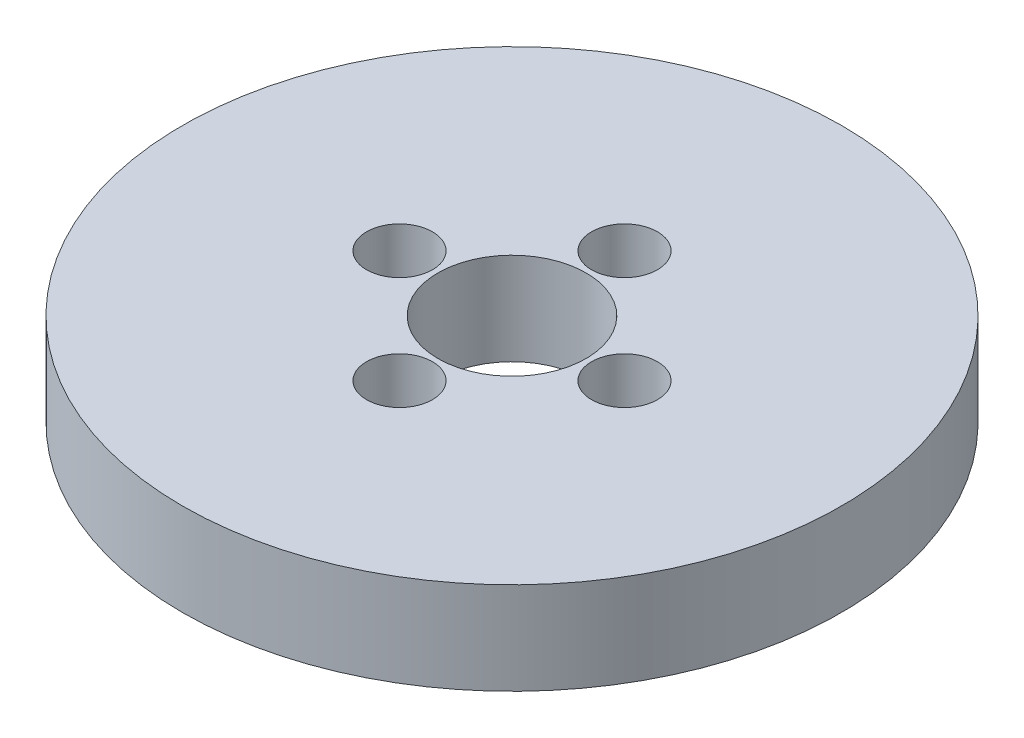
ISO-10303-21;
HEADER;
FILE_DESCRIPTION(('STEP AP214'),'2;1');
FILE_NAME('part.step','',(''),(''),'','','');
FILE_SCHEMA(('AUTOMOTIVE_DESIGN { 1 0 10303 214 1 1 1 1 }'));
ENDSEC;
DATA;
#1=APPLICATION_CONTEXT('core data for automotive mechanical design processes');
#2=APPLICATION_PROTOCOL_DEFINITION('international standard','automotive_design',2000,#1);
#3=PRODUCT_CONTEXT('',#1,'mechanical');
#4=PRODUCT('Part','Part','',(#3));
#5=PRODUCT_RELATED_PRODUCT_CATEGORY('part','',(#4));
#6=PRODUCT_DEFINITION_FORMATION('','',#4);
#7=PRODUCT_DEFINITION_CONTEXT('part definition',#1,'design');
#8=PRODUCT_DEFINITION('design','',#6,#7);
#9=PRODUCT_DEFINITION_SHAPE('','',#8);
#10=(LENGTH_UNIT() NAMED_UNIT(*) SI_UNIT(.MILLI.,.METRE.));
#11=(NAMED_UNIT(*) PLANE_ANGLE_UNIT() SI_UNIT($,.RADIAN.));
#12=(NAMED_UNIT(*) SI_UNIT($,.STERADIAN.) SOLID_ANGLE_UNIT());
#13=UNCERTAINTY_MEASURE_WITH_UNIT(LENGTH_MEASURE(1.E-05),#10,'distance_accuracy_value','');
#14=(GEOMETRIC_REPRESENTATION_CONTEXT(3) GLOBAL_UNCERTAINTY_ASSIGNED_CONTEXT((#13)) GLOBAL_UNIT_ASSIGNED_CONTEXT((#10,
#11,#12)) REPRESENTATION_CONTEXT('',''));
#15=CARTESIAN_POINT('',(0.,0.,0.));
#16=DIRECTION('',(0.,0.,1.));
#17=DIRECTION('',(1.,0.,0.));
#18=AXIS2_PLACEMENT_3D('',#15,#16,#17);
#19=CARTESIAN_POINT('',(0.,28.,0.));
#20=DIRECTION('',(0.,-1.,0.));
#21=DIRECTION('',(0.,0.,-1.));
#22=AXIS2_PLACEMENT_3D('',#19,#20,#21);
#23=CYLINDRICAL_SURFACE('',#22,100.);
#24=CARTESIAN_POINT('',(0.,28.,0.));
#25=DIRECTION('',(0.,1.,0.));
#26=DIRECTION('',(0.,0.,1.));
#27=AXIS2_PLACEMENT_3D('',#24,#25,#26);
#28=CIRCLE('',#27,100.);
#29=CARTESIAN_POINT('',(0.,28.,100.));
#30=VERTEX_POINT('',#29);
#31=EDGE_CURVE('E10',#30,#30,#28,.T.);
#32=ORIENTED_EDGE('',*,*,#31,.F.);
#33=EDGE_LOOP('',(#32));
#34=FACE_BOUND('',#33,.T.);
#35=CARTESIAN_POINT('',(0.,0.,0.));
#36=DIRECTION('',(0.,1.,0.));
#37=DIRECTION('',(0.,0.,1.));
#38=AXIS2_PLACEMENT_3D('',#35,#36,#37);
#39=CIRCLE('',#38,100.);
#40=CARTESIAN_POINT('',(0.,0.,100.));
#41=VERTEX_POINT('',#40);
#42=EDGE_CURVE('E37',#41,#41,#39,.T.);
#43=ORIENTED_EDGE('',*,*,#42,.T.);
#44=EDGE_LOOP('',(#43));
#45=FACE_BOUND('',#44,.T.);
#46=ADVANCED_FACE('F40',(#34,#45),#23,.T.);
#47=CARTESIAN_POINT('',(0.,28.,0.));
#48=DIRECTION('',(0.,1.,0.));
#49=DIRECTION('',(0.,0.,1.));
#50=AXIS2_PLACEMENT_3D('',#47,#48,#49);
#51=PLANE('',#50);
#52=CARTESIAN_POINT('',(1.19188812936759E-13,28.,34.1370327862761));
#53=DIRECTION('',(0.,1.,0.));
#54=DIRECTION('',(1.,0.,0.));
#55=AXIS2_PLACEMENT_3D('',#52,#53,#54);
#56=CIRCLE('',#55,10.);
#57=CARTESIAN_POINT('',(10.0000000000001,28.,34.137032786276));
#58=VERTEX_POINT('',#57);
#59=EDGE_CURVE('E71',#58,#58,#56,.T.);
#60=ORIENTED_EDGE('',*,*,#59,.F.);
#61=EDGE_LOOP('',(#60));
#62=FACE_BOUND('',#61,.T.);
#63=CARTESIAN_POINT('',(34.1370327862761,28.,0.));
#64=DIRECTION('',(0.,1.,0.));
#65=DIRECTION('',(0.,0.,-1.));
#66=AXIS2_PLACEMENT_3D('',#63,#64,#65);
#67=CIRCLE('',#66,10.);
#68=CARTESIAN_POINT('',(34.1370327862761,28.,-10.));
#69=VERTEX_POINT('',#68);
#70=EDGE_CURVE('E70',#69,#69,#67,.T.);
#71=ORIENTED_EDGE('',*,*,#70,.F.);
#72=EDGE_LOOP('',(#71));
#73=FACE_BOUND('',#72,.T.);
#74=CARTESIAN_POINT('',(-3.57566438810277E-13,28.,-34.1370327862761));
#75=DIRECTION('',(0.,1.,0.));
#76=DIRECTION('',(-1.,0.,0.));
#77=AXIS2_PLACEMENT_3D('',#74,#75,#76);
#78=CIRCLE('',#77,10.);
#79=CARTESIAN_POINT('',(-10.0000000000004,28.,-34.137032786276));
#80=VERTEX_POINT('',#79);
#81=EDGE_CURVE('E61',#80,#80,#78,.T.);
#82=ORIENTED_EDGE('',*,*,#81,.F.);
#83=EDGE_LOOP('',(#82));
#84=FACE_BOUND('',#83,.T.);
#85=CARTESIAN_POINT('',(-34.1370327862761,28.,0.));
#86=DIRECTION('',(0.,1.,0.));
#87=DIRECTION('',(0.,0.,1.));
#88=AXIS2_PLACEMENT_3D('',#85,#86,#87);
#89=CIRCLE('',#88,10.);
#90=CARTESIAN_POINT('',(-34.1370327862761,28.,10.));
#91=VERTEX_POINT('',#90);
#92=EDGE_CURVE('E54',#91,#91,#89,.T.);
#93=ORIENTED_EDGE('',*,*,#92,.F.);
#94=EDGE_LOOP('',(#93));
#95=FACE_BOUND('',#94,.T.);
#96=CARTESIAN_POINT('',(0.,28.,0.));
#97=DIRECTION('',(0.,1.,0.));
#98=DIRECTION('',(0.,0.,1.));
#99=AXIS2_PLACEMENT_3D('',#96,#97,#98);
#100=CIRCLE('',#99,22.5);
#101=CARTESIAN_POINT('',(0.,28.,22.5));
#102=VERTEX_POINT('',#101);
#103=EDGE_CURVE('E50',#102,#102,#100,.T.);
#104=ORIENTED_EDGE('',*,*,#103,.F.);
#105=EDGE_LOOP('',(#104));
#106=FACE_BOUND('',#105,.T.);
#107=ORIENTED_EDGE('',*,*,#31,.T.);
#108=EDGE_LOOP('',(#107));
#109=FACE_BOUND('',#108,.T.);
#110=ADVANCED_FACE('F86',(#62,#73,#84,#95,#106,#109),#51,.T.);
#111=CARTESIAN_POINT('',(0.,0.,0.));
#112=DIRECTION('',(0.,1.,0.));
#113=DIRECTION('',(0.,0.,1.));
#114=AXIS2_PLACEMENT_3D('',#111,#112,#113);
#115=PLANE('',#114);
#116=CARTESIAN_POINT('',(0.,0.,0.));
#117=DIRECTION('',(0.,1.,0.));
#118=DIRECTION('',(0.,0.,1.));
#119=AXIS2_PLACEMENT_3D('',#116,#117,#118);
#120=CIRCLE('',#119,22.5);
#121=CARTESIAN_POINT('',(0.,0.,22.5));
#122=VERTEX_POINT('',#121);
#123=EDGE_CURVE('E47',#122,#122,#120,.T.);
#124=ORIENTED_EDGE('',*,*,#123,.T.);
#125=EDGE_LOOP('',(#124));
#126=FACE_BOUND('',#125,.T.);
#127=ORIENTED_EDGE('',*,*,#42,.F.);
#128=EDGE_LOOP('',(#127));
#129=FACE_BOUND('',#128,.T.);
#130=ADVANCED_FACE('F93',(#126,#129),#115,.F.);
#131=CARTESIAN_POINT('',(0.,28.,0.));
#132=DIRECTION('',(0.,-1.,0.));
#133=DIRECTION('',(0.,0.,-1.));
#134=AXIS2_PLACEMENT_3D('',#131,#132,#133);
#135=CYLINDRICAL_SURFACE('',#134,22.5);
#136=ORIENTED_EDGE('',*,*,#103,.T.);
#137=EDGE_LOOP('',(#136));
#138=FACE_BOUND('',#137,.T.);
#139=ORIENTED_EDGE('',*,*,#123,.F.);
#140=EDGE_LOOP('',(#139));
#141=FACE_BOUND('',#140,.T.);
#142=ADVANCED_FACE('F101',(#138,#141),#135,.F.);
#143=CARTESIAN_POINT('',(-34.1370327862761,5.18105108486817,0.));
#144=DIRECTION('',(0.,1.,0.));
#145=DIRECTION('',(0.,0.,1.));
#146=AXIS2_PLACEMENT_3D('',#143,#144,#145);
#147=CYLINDRICAL_SURFACE('',#146,10.);
#148=CARTESIAN_POINT('',(-34.1370327862761,5.18105108486817,0.));
#149=DIRECTION('',(0.,1.,0.));
#150=DIRECTION('',(0.,0.,1.));
#151=AXIS2_PLACEMENT_3D('',#148,#149,#150);
#152=CIRCLE('',#151,10.);
#153=CARTESIAN_POINT('',(-34.1370327862761,5.18105108486817,10.));
#154=VERTEX_POINT('',#153);
#155=EDGE_CURVE('E55',#154,#154,#152,.T.);
#156=ORIENTED_EDGE('',*,*,#155,.F.);
#157=EDGE_LOOP('',(#156));
#158=FACE_BOUND('',#157,.T.);
#159=ORIENTED_EDGE('',*,*,#92,.T.);
#160=EDGE_LOOP('',(#159));
#161=FACE_BOUND('',#160,.T.);
#162=ADVANCED_FACE('F102',(#158,#161),#147,.F.);
#163=CARTESIAN_POINT('',(-34.1370327862761,5.18105108486817,0.));
#164=DIRECTION('',(0.,1.,0.));
#165=DIRECTION('',(0.,0.,1.));
#166=AXIS2_PLACEMENT_3D('',#163,#164,#165);
#167=PLANE('',#166);
#168=ORIENTED_EDGE('',*,*,#155,.T.);
#169=EDGE_LOOP('',(#168));
#170=FACE_BOUND('',#169,.T.);
#171=ADVANCED_FACE('F133',(#170),#167,.T.);
#172=CARTESIAN_POINT('',(-3.57566438810277E-13,5.18105108486817,-34.1370327862761));
#173=DIRECTION('',(0.,1.,0.));
#174=DIRECTION('',(0.,0.,1.));
#175=AXIS2_PLACEMENT_3D('',#172,#173,#174);
#176=CYLINDRICAL_SURFACE('',#175,10.);
#177=CARTESIAN_POINT('',(-3.57566438810277E-13,5.18105108486817,-34.1370327862761));
#178=DIRECTION('',(0.,1.,0.));
#179=DIRECTION('',(-1.,0.,0.));
#180=AXIS2_PLACEMENT_3D('',#177,#178,#179);
#181=CIRCLE('',#180,10.);
#182=CARTESIAN_POINT('',(-10.0000000000004,5.18105108486817,-34.137032786276));
#183=VERTEX_POINT('',#182);
#184=EDGE_CURVE('E63',#183,#183,#181,.T.);
#185=ORIENTED_EDGE('',*,*,#184,.F.);
#186=EDGE_LOOP('',(#185));
#187=FACE_BOUND('',#186,.T.);
#188=ORIENTED_EDGE('',*,*,#81,.T.);
#189=EDGE_LOOP('',(#188));
#190=FACE_BOUND('',#189,.T.);
#191=ADVANCED_FACE('F142',(#187,#190),#176,.F.);
#192=CARTESIAN_POINT('',(-3.57566438810277E-13,5.18105108486817,-34.1370327862761));
#193=DIRECTION('',(0.,1.,0.));
#194=DIRECTION('',(-1.,0.,0.));
#195=AXIS2_PLACEMENT_3D('',#192,#193,#194);
#196=PLANE('',#195);
#197=ORIENTED_EDGE('',*,*,#184,.T.);
#198=EDGE_LOOP('',(#197));
#199=FACE_BOUND('',#198,.T.);
#200=ADVANCED_FACE('F156',(#199),#196,.T.);
#201=CARTESIAN_POINT('',(34.1370327862761,5.18105108486817,0.));
#202=DIRECTION('',(0.,1.,0.));
#203=DIRECTION('',(0.,0.,1.));
#204=AXIS2_PLACEMENT_3D('',#201,#202,#203);
#205=CYLINDRICAL_SURFACE('',#204,10.);
#206=CARTESIAN_POINT('',(34.1370327862761,5.18105108486817,0.));
#207=DIRECTION('',(0.,1.,0.));
#208=DIRECTION('',(0.,0.,-1.));
#209=AXIS2_PLACEMENT_3D('',#206,#207,#208);
#210=CIRCLE('',#209,10.);
#211=CARTESIAN_POINT('',(34.1370327862761,5.18105108486817,-10.));
#212=VERTEX_POINT('',#211);
#213=EDGE_CURVE('E69',#212,#212,#210,.T.);
#214=ORIENTED_EDGE('',*,*,#213,.F.);
#215=EDGE_LOOP('',(#214));
#216=FACE_BOUND('',#215,.T.);
#217=ORIENTED_EDGE('',*,*,#70,.T.);
#218=EDGE_LOOP('',(#217));
#219=FACE_BOUND('',#218,.T.);
#220=ADVANCED_FACE('F164',(#216,#219),#205,.F.);
#221=CARTESIAN_POINT('',(34.1370327862761,5.18105108486817,0.));
#222=DIRECTION('',(0.,1.,0.));
#223=DIRECTION('',(0.,0.,-1.));
#224=AXIS2_PLACEMENT_3D('',#221,#222,#223);
#225=PLANE('',#224);
#226=ORIENTED_EDGE('',*,*,#213,.T.);
#227=EDGE_LOOP('',(#226));
#228=FACE_BOUND('',#227,.T.);
#229=ADVANCED_FACE('F83',(#228),#225,.T.);
#230=CARTESIAN_POINT('',(1.19188812936759E-13,5.18105108486817,34.1370327862761));
#231=DIRECTION('',(0.,1.,0.));
#232=DIRECTION('',(0.,0.,1.));
#233=AXIS2_PLACEMENT_3D('',#230,#231,#232);
#234=CYLINDRICAL_SURFACE('',#233,10.);
#235=CARTESIAN_POINT('',(1.19188812936759E-13,5.18105108486817,34.1370327862761));
#236=DIRECTION('',(0.,1.,0.));
#237=DIRECTION('',(1.,0.,0.));
#238=AXIS2_PLACEMENT_3D('',#235,#236,#237);
#239=CIRCLE('',#238,10.);
#240=CARTESIAN_POINT('',(10.0000000000001,5.18105108486817,34.137032786276));
#241=VERTEX_POINT('',#240);
#242=EDGE_CURVE('E59',#241,#241,#239,.T.);
#243=ORIENTED_EDGE('',*,*,#242,.F.);
#244=EDGE_LOOP('',(#243));
#245=FACE_BOUND('',#244,.T.);
#246=ORIENTED_EDGE('',*,*,#59,.T.);
#247=EDGE_LOOP('',(#246));
#248=FACE_BOUND('',#247,.T.);
#249=ADVANCED_FACE('F81',(#245,#248),#234,.F.);
#250=CARTESIAN_POINT('',(1.19188812936759E-13,5.18105108486817,34.1370327862761));
#251=DIRECTION('',(0.,1.,0.));
#252=DIRECTION('',(1.,0.,0.));
#253=AXIS2_PLACEMENT_3D('',#250,#251,#252);
#254=PLANE('',#253);
#255=ORIENTED_EDGE('',*,*,#242,.T.);
#256=EDGE_LOOP('',(#255));
#257=FACE_BOUND('',#256,.T.);
#258=ADVANCED_FACE('F78',(#257),#254,.T.);
#259=CLOSED_SHELL('',(#46,#110,#130,#142,#162,#171,#191,#200,#220,#229,#249,#258));
#260=MANIFOLD_SOLID_BREP('B2',#259);
#261=ADVANCED_BREP_SHAPE_REPRESENTATION('',(#18,#260),#14);
#262=SHAPE_DEFINITION_REPRESENTATION(#9,#261);
ENDSEC;
END-ISO-10303-21;
